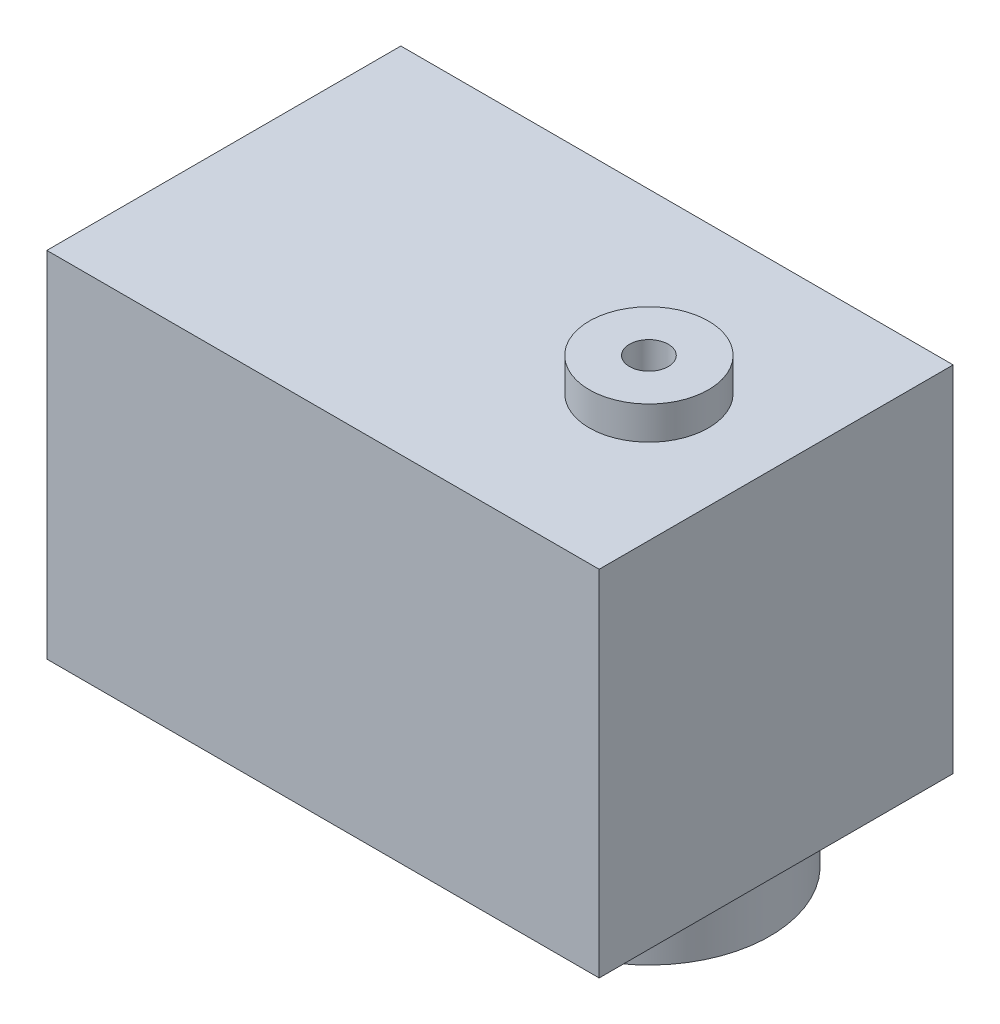
ISO-10303-21;
HEADER;
FILE_DESCRIPTION(('STEP AP214'),'2;1');
FILE_NAME('part.step','',(''),(''),'','','');
FILE_SCHEMA(('AUTOMOTIVE_DESIGN { 1 0 10303 214 1 1 1 1 }'));
ENDSEC;
DATA;
#1=APPLICATION_CONTEXT('core data for automotive mechanical design processes');
#2=APPLICATION_PROTOCOL_DEFINITION('international standard','automotive_design',2000,#1);
#3=PRODUCT_CONTEXT('',#1,'mechanical');
#4=PRODUCT('Part','Part','',(#3));
#5=PRODUCT_RELATED_PRODUCT_CATEGORY('part','',(#4));
#6=PRODUCT_DEFINITION_FORMATION('','',#4);
#7=PRODUCT_DEFINITION_CONTEXT('part definition',#1,'design');
#8=PRODUCT_DEFINITION('design','',#6,#7);
#9=PRODUCT_DEFINITION_SHAPE('','',#8);
#10=(LENGTH_UNIT() NAMED_UNIT(*) SI_UNIT(.MILLI.,.METRE.));
#11=(NAMED_UNIT(*) PLANE_ANGLE_UNIT() SI_UNIT($,.RADIAN.));
#12=(NAMED_UNIT(*) SI_UNIT($,.STERADIAN.) SOLID_ANGLE_UNIT());
#13=UNCERTAINTY_MEASURE_WITH_UNIT(LENGTH_MEASURE(1.E-05),#10,'distance_accuracy_value','');
#14=(GEOMETRIC_REPRESENTATION_CONTEXT(3) GLOBAL_UNCERTAINTY_ASSIGNED_CONTEXT((#13)) GLOBAL_UNIT_ASSIGNED_CONTEXT((#10,
#11,#12)) REPRESENTATION_CONTEXT('',''));
#15=CARTESIAN_POINT('',(0.,0.,0.));
#16=DIRECTION('',(0.,0.,1.));
#17=DIRECTION('',(1.,0.,0.));
#18=AXIS2_PLACEMENT_3D('',#15,#16,#17);
#19=CARTESIAN_POINT('',(-38.4302,-32.004,16.002));
#20=DIRECTION('',(0.,1.,0.));
#21=DIRECTION('',(0.,0.,1.));
#22=AXIS2_PLACEMENT_3D('',#19,#20,#21);
#23=PLANE('',#22);
#24=DIRECTION('',(0.,0.,1.));
#25=VECTOR('',#24,1.);
#26=CARTESIAN_POINT('',(-38.4302,-32.004,-16.002));
#27=LINE('',#26,#25);
#28=CARTESIAN_POINT('',(-38.4302,-32.004,-16.002));
#29=VERTEX_POINT('',#28);
#30=CARTESIAN_POINT('',(-38.4302,-32.004,16.002));
#31=VERTEX_POINT('',#30);
#32=EDGE_CURVE('E404',#29,#31,#27,.T.);
#33=ORIENTED_EDGE('',*,*,#32,.F.);
#34=DIRECTION('',(-1.,0.,0.));
#35=VECTOR('',#34,1.);
#36=CARTESIAN_POINT('',(-38.4302,-32.004,-16.002));
#37=LINE('',#36,#35);
#38=CARTESIAN_POINT('',(11.5062,-32.004,-16.002));
#39=VERTEX_POINT('',#38);
#40=EDGE_CURVE('E409',#39,#29,#37,.T.);
#41=ORIENTED_EDGE('',*,*,#40,.F.);
#42=DIRECTION('',(0.,0.,-1.));
#43=VECTOR('',#42,1.);
#44=CARTESIAN_POINT('',(11.5062,-32.004,-16.002));
#45=LINE('',#44,#43);
#46=CARTESIAN_POINT('',(11.5062,-32.004,16.002));
#47=VERTEX_POINT('',#46);
#48=EDGE_CURVE('E433',#47,#39,#45,.T.);
#49=ORIENTED_EDGE('',*,*,#48,.F.);
#50=DIRECTION('',(1.,0.,0.));
#51=VECTOR('',#50,1.);
#52=CARTESIAN_POINT('',(-38.4302,-32.004,16.002));
#53=LINE('',#52,#51);
#54=EDGE_CURVE('E431',#31,#47,#53,.T.);
#55=ORIENTED_EDGE('',*,*,#54,.F.);
#56=EDGE_LOOP('',(#33,#41,#49,#55));
#57=FACE_BOUND('',#56,.T.);
#58=CARTESIAN_POINT('',(0.,-32.004,0.));
#59=DIRECTION('',(0.,1.,0.));
#60=DIRECTION('',(0.,0.,1.));
#61=AXIS2_PLACEMENT_3D('',#58,#59,#60);
#62=CIRCLE('',#61,10.9474);
#63=CARTESIAN_POINT('',(0.,-32.004,10.9474));
#64=VERTEX_POINT('',#63);
#65=EDGE_CURVE('E11',#64,#64,#62,.F.);
#66=ORIENTED_EDGE('',*,*,#65,.F.);
#67=EDGE_LOOP('',(#66));
#68=FACE_BOUND('',#67,.T.);
#69=ADVANCED_FACE('F360',(#57,#68),#23,.F.);
#70=CARTESIAN_POINT('',(-38.4302,0.,16.002));
#71=DIRECTION('',(0.,1.,0.));
#72=DIRECTION('',(0.,0.,1.));
#73=AXIS2_PLACEMENT_3D('',#70,#71,#72);
#74=PLANE('',#73);
#75=DIRECTION('',(0.,0.,1.));
#76=VECTOR('',#75,1.);
#77=CARTESIAN_POINT('',(-38.4302,0.,-16.002));
#78=LINE('',#77,#76);
#79=CARTESIAN_POINT('',(-38.4302,0.,-16.002));
#80=VERTEX_POINT('',#79);
#81=CARTESIAN_POINT('',(-38.4302,0.,16.002));
#82=VERTEX_POINT('',#81);
#83=EDGE_CURVE('E402',#80,#82,#78,.T.);
#84=ORIENTED_EDGE('',*,*,#83,.T.);
#85=DIRECTION('',(1.,0.,0.));
#86=VECTOR('',#85,1.);
#87=CARTESIAN_POINT('',(-38.4302,0.,16.002));
#88=LINE('',#87,#86);
#89=CARTESIAN_POINT('',(11.5062,0.,16.002));
#90=VERTEX_POINT('',#89);
#91=EDGE_CURVE('E411',#82,#90,#88,.T.);
#92=ORIENTED_EDGE('',*,*,#91,.T.);
#93=DIRECTION('',(0.,0.,-1.));
#94=VECTOR('',#93,1.);
#95=CARTESIAN_POINT('',(11.5062,0.,-16.002));
#96=LINE('',#95,#94);
#97=CARTESIAN_POINT('',(11.5062,0.,-16.002));
#98=VERTEX_POINT('',#97);
#99=EDGE_CURVE('E416',#90,#98,#96,.T.);
#100=ORIENTED_EDGE('',*,*,#99,.T.);
#101=DIRECTION('',(-1.,0.,0.));
#102=VECTOR('',#101,1.);
#103=CARTESIAN_POINT('',(-38.4302,0.,-16.002));
#104=LINE('',#103,#102);
#105=EDGE_CURVE('E420',#98,#80,#104,.T.);
#106=ORIENTED_EDGE('',*,*,#105,.T.);
#107=EDGE_LOOP('',(#84,#92,#100,#106));
#108=FACE_BOUND('',#107,.T.);
#109=CARTESIAN_POINT('',(0.,0.,0.));
#110=DIRECTION('',(0.,1.,0.));
#111=DIRECTION('',(0.,0.,1.));
#112=AXIS2_PLACEMENT_3D('',#109,#110,#111);
#113=CIRCLE('',#112,5.3848);
#114=CARTESIAN_POINT('',(0.,0.,5.3848));
#115=VERTEX_POINT('',#114);
#116=EDGE_CURVE('E424',#115,#115,#113,.T.);
#117=ORIENTED_EDGE('',*,*,#116,.F.);
#118=EDGE_LOOP('',(#117));
#119=FACE_BOUND('',#118,.T.);
#120=ADVANCED_FACE('F418',(#108,#119),#74,.T.);
#121=CARTESIAN_POINT('',(-38.4302,-32.004,-16.002));
#122=DIRECTION('',(-1.,0.,0.));
#123=DIRECTION('',(0.,0.,1.));
#124=AXIS2_PLACEMENT_3D('',#121,#122,#123);
#125=PLANE('',#124);
#126=ORIENTED_EDGE('',*,*,#83,.F.);
#127=DIRECTION('',(0.,1.,0.));
#128=VECTOR('',#127,1.);
#129=CARTESIAN_POINT('',(-38.4302,-32.004,-16.002));
#130=LINE('',#129,#128);
#131=EDGE_CURVE('E368',#29,#80,#130,.T.);
#132=ORIENTED_EDGE('',*,*,#131,.F.);
#133=ORIENTED_EDGE('',*,*,#32,.T.);
#134=DIRECTION('',(0.,1.,0.));
#135=VECTOR('',#134,1.);
#136=CARTESIAN_POINT('',(-38.4302,-32.004,16.002));
#137=LINE('',#136,#135);
#138=EDGE_CURVE('E399',#31,#82,#137,.T.);
#139=ORIENTED_EDGE('',*,*,#138,.T.);
#140=EDGE_LOOP('',(#126,#132,#133,#139));
#141=FACE_BOUND('',#140,.T.);
#142=ADVANCED_FACE('F362',(#141),#125,.T.);
#143=CARTESIAN_POINT('',(-38.4302,-32.004,-16.002));
#144=DIRECTION('',(0.,0.,-1.));
#145=DIRECTION('',(-1.,0.,0.));
#146=AXIS2_PLACEMENT_3D('',#143,#144,#145);
#147=PLANE('',#146);
#148=ORIENTED_EDGE('',*,*,#105,.F.);
#149=DIRECTION('',(0.,1.,0.));
#150=VECTOR('',#149,1.);
#151=CARTESIAN_POINT('',(11.5062,-32.004,-16.002));
#152=LINE('',#151,#150);
#153=EDGE_CURVE('E382',#39,#98,#152,.T.);
#154=ORIENTED_EDGE('',*,*,#153,.F.);
#155=ORIENTED_EDGE('',*,*,#40,.T.);
#156=ORIENTED_EDGE('',*,*,#131,.T.);
#157=EDGE_LOOP('',(#148,#154,#155,#156));
#158=FACE_BOUND('',#157,.T.);
#159=ADVANCED_FACE('F442',(#158),#147,.T.);
#160=CARTESIAN_POINT('',(11.5062,-32.004,-16.002));
#161=DIRECTION('',(1.,0.,0.));
#162=DIRECTION('',(0.,0.,-1.));
#163=AXIS2_PLACEMENT_3D('',#160,#161,#162);
#164=PLANE('',#163);
#165=ORIENTED_EDGE('',*,*,#99,.F.);
#166=DIRECTION('',(0.,1.,0.));
#167=VECTOR('',#166,1.);
#168=CARTESIAN_POINT('',(11.5062,-32.004,16.002));
#169=LINE('',#168,#167);
#170=EDGE_CURVE('E408',#47,#90,#169,.T.);
#171=ORIENTED_EDGE('',*,*,#170,.F.);
#172=ORIENTED_EDGE('',*,*,#48,.T.);
#173=ORIENTED_EDGE('',*,*,#153,.T.);
#174=EDGE_LOOP('',(#165,#171,#172,#173));
#175=FACE_BOUND('',#174,.T.);
#176=ADVANCED_FACE('F439',(#175),#164,.T.);
#177=CARTESIAN_POINT('',(-38.4302,-32.004,16.002));
#178=DIRECTION('',(0.,0.,1.));
#179=DIRECTION('',(1.,0.,0.));
#180=AXIS2_PLACEMENT_3D('',#177,#178,#179);
#181=PLANE('',#180);
#182=ORIENTED_EDGE('',*,*,#91,.F.);
#183=ORIENTED_EDGE('',*,*,#138,.F.);
#184=ORIENTED_EDGE('',*,*,#54,.T.);
#185=ORIENTED_EDGE('',*,*,#170,.T.);
#186=EDGE_LOOP('',(#182,#183,#184,#185));
#187=FACE_BOUND('',#186,.T.);
#188=ADVANCED_FACE('F412',(#187),#181,.T.);
#189=CARTESIAN_POINT('',(0.,2.99085,0.));
#190=DIRECTION('',(0.,-1.,0.));
#191=DIRECTION('',(0.,0.,-1.));
#192=AXIS2_PLACEMENT_3D('',#189,#190,#191);
#193=CYLINDRICAL_SURFACE('',#192,5.3848);
#194=CARTESIAN_POINT('',(0.,2.99085,0.));
#195=DIRECTION('',(0.,1.,0.));
#196=DIRECTION('',(0.,0.,1.));
#197=AXIS2_PLACEMENT_3D('',#194,#195,#196);
#198=CIRCLE('',#197,5.3848);
#199=CARTESIAN_POINT('',(0.,2.99085,5.3848));
#200=VERTEX_POINT('',#199);
#201=EDGE_CURVE('E421',#200,#200,#198,.T.);
#202=ORIENTED_EDGE('',*,*,#201,.F.);
#203=EDGE_LOOP('',(#202));
#204=FACE_BOUND('',#203,.T.);
#205=ORIENTED_EDGE('',*,*,#116,.T.);
#206=EDGE_LOOP('',(#205));
#207=FACE_BOUND('',#206,.T.);
#208=ADVANCED_FACE('F474',(#204,#207),#193,.T.);
#209=CARTESIAN_POINT('',(0.,2.99085,0.));
#210=DIRECTION('',(0.,1.,0.));
#211=DIRECTION('',(0.,0.,1.));
#212=AXIS2_PLACEMENT_3D('',#209,#210,#211);
#213=PLANE('',#212);
#214=CARTESIAN_POINT('',(0.,2.99085,0.));
#215=DIRECTION('',(0.,1.,0.));
#216=DIRECTION('',(0.,0.,1.));
#217=AXIS2_PLACEMENT_3D('',#214,#215,#216);
#218=CIRCLE('',#217,1.7526);
#219=CARTESIAN_POINT('',(0.,2.99085,1.7526));
#220=VERTEX_POINT('',#219);
#221=EDGE_CURVE('E542',#220,#220,#218,.T.);
#222=ORIENTED_EDGE('',*,*,#221,.F.);
#223=EDGE_LOOP('',(#222));
#224=FACE_BOUND('',#223,.T.);
#225=ORIENTED_EDGE('',*,*,#201,.T.);
#226=EDGE_LOOP('',(#225));
#227=FACE_BOUND('',#226,.T.);
#228=ADVANCED_FACE('F470',(#224,#227),#213,.T.);
#229=CARTESIAN_POINT('',(0.,-8.99795,0.));
#230=DIRECTION('',(0.,1.,0.));
#231=DIRECTION('',(0.,0.,1.));
#232=AXIS2_PLACEMENT_3D('',#229,#230,#231);
#233=CYLINDRICAL_SURFACE('',#232,1.7526);
#234=CARTESIAN_POINT('',(0.,-8.99795,0.));
#235=DIRECTION('',(0.,1.,0.));
#236=DIRECTION('',(0.,0.,1.));
#237=AXIS2_PLACEMENT_3D('',#234,#235,#236);
#238=CIRCLE('',#237,1.7526);
#239=CARTESIAN_POINT('',(0.,-8.99795,1.7526));
#240=VERTEX_POINT('',#239);
#241=EDGE_CURVE('E549',#240,#240,#238,.T.);
#242=CARTESIAN_POINT('',(0.,-8.99795,1.7526));
#243=CARTESIAN_POINT('',(0.,-8.87306666666667,1.7526));
#244=CARTESIAN_POINT('',(0.,-8.74818333333334,1.7526));
#245=CARTESIAN_POINT('',(0.,-8.49841666666667,1.7526));
#246=CARTESIAN_POINT('',(0.,-8.37353333333333,1.7526));
#247=CARTESIAN_POINT('',(0.,-8.12376666666667,1.7526));
#248=CARTESIAN_POINT('',(0.,-7.99888333333333,1.7526));
#249=CARTESIAN_POINT('',(0.,-7.74911666666667,1.7526));
#250=CARTESIAN_POINT('',(0.,-7.62423333333333,1.7526));
#251=CARTESIAN_POINT('',(0.,-7.37446666666667,1.7526));
#252=CARTESIAN_POINT('',(0.,-7.24958333333333,1.7526));
#253=CARTESIAN_POINT('',(0.,-6.99981666666667,1.7526));
#254=CARTESIAN_POINT('',(0.,-6.87493333333333,1.7526));
#255=CARTESIAN_POINT('',(0.,-6.62516666666667,1.7526));
#256=CARTESIAN_POINT('',(0.,-6.50028333333333,1.7526));
#257=CARTESIAN_POINT('',(0.,-6.25051666666667,1.7526));
#258=CARTESIAN_POINT('',(0.,-6.12563333333333,1.7526));
#259=CARTESIAN_POINT('',(0.,-5.87586666666667,1.7526));
#260=CARTESIAN_POINT('',(0.,-5.75098333333333,1.7526));
#261=CARTESIAN_POINT('',(0.,-5.50121666666667,1.7526));
#262=CARTESIAN_POINT('',(0.,-5.37633333333333,1.7526));
#263=CARTESIAN_POINT('',(0.,-5.12656666666667,1.7526));
#264=CARTESIAN_POINT('',(0.,-5.00168333333333,1.7526));
#265=CARTESIAN_POINT('',(0.,-4.75191666666667,1.7526));
#266=CARTESIAN_POINT('',(0.,-4.62703333333333,1.7526));
#267=CARTESIAN_POINT('',(0.,-4.37726666666667,1.7526));
#268=CARTESIAN_POINT('',(0.,-4.25238333333333,1.7526));
#269=CARTESIAN_POINT('',(0.,-4.00261666666667,1.7526));
#270=CARTESIAN_POINT('',(0.,-3.87773333333333,1.7526));
#271=CARTESIAN_POINT('',(0.,-3.62796666666667,1.7526));
#272=CARTESIAN_POINT('',(0.,-3.50308333333333,1.7526));
#273=CARTESIAN_POINT('',(0.,-3.25331666666667,1.7526));
#274=CARTESIAN_POINT('',(0.,-3.12843333333333,1.7526));
#275=CARTESIAN_POINT('',(0.,-2.87866666666667,1.7526));
#276=CARTESIAN_POINT('',(0.,-2.75378333333333,1.7526));
#277=CARTESIAN_POINT('',(0.,-2.50401666666667,1.7526));
#278=CARTESIAN_POINT('',(0.,-2.37913333333333,1.7526));
#279=CARTESIAN_POINT('',(0.,-2.12936666666667,1.7526));
#280=CARTESIAN_POINT('',(0.,-2.00448333333333,1.7526));
#281=CARTESIAN_POINT('',(0.,-1.75471666666667,1.7526));
#282=CARTESIAN_POINT('',(0.,-1.62983333333333,1.7526));
#283=CARTESIAN_POINT('',(0.,-1.38006666666667,1.7526));
#284=CARTESIAN_POINT('',(0.,-1.25518333333333,1.7526));
#285=CARTESIAN_POINT('',(0.,-1.00541666666667,1.7526));
#286=CARTESIAN_POINT('',(0.,-0.880533333333335,1.7526));
#287=CARTESIAN_POINT('',(0.,-0.630766666666668,1.7526));
#288=CARTESIAN_POINT('',(0.,-0.505883333333335,1.7526));
#289=CARTESIAN_POINT('',(0.,-0.256116666666668,1.7526));
#290=CARTESIAN_POINT('',(0.,-0.131233333333334,1.7526));
#291=CARTESIAN_POINT('',(0.,0.118533333333333,1.7526));
#292=CARTESIAN_POINT('',(0.,0.243416666666666,1.7526));
#293=CARTESIAN_POINT('',(0.,0.493183333333332,1.7526));
#294=CARTESIAN_POINT('',(0.,0.618066666666666,1.7526));
#295=CARTESIAN_POINT('',(0.,0.867833333333333,1.7526));
#296=CARTESIAN_POINT('',(0.,0.992716666666666,1.7526));
#297=CARTESIAN_POINT('',(0.,1.24248333333333,1.7526));
#298=CARTESIAN_POINT('',(0.,1.36736666666667,1.7526));
#299=CARTESIAN_POINT('',(0.,1.61713333333333,1.7526));
#300=CARTESIAN_POINT('',(0.,1.74201666666667,1.7526));
#301=CARTESIAN_POINT('',(0.,1.99178333333333,1.7526));
#302=CARTESIAN_POINT('',(0.,2.11666666666667,1.7526));
#303=CARTESIAN_POINT('',(0.,2.36643333333333,1.7526));
#304=CARTESIAN_POINT('',(0.,2.49131666666667,1.7526));
#305=CARTESIAN_POINT('',(0.,2.74108333333333,1.7526));
#306=CARTESIAN_POINT('',(0.,2.86596666666667,1.7526));
#307=CARTESIAN_POINT('',(0.,2.99085,1.7526));
#308=B_SPLINE_CURVE_WITH_KNOTS('',3,(#242,#243,#244,#245,#246,#247,#248,#249,#250,#251,#252,
#253,#254,#255,#256,#257,#258,#259,#260,#261,#262,#263,#264,#265,#266,#267,#268,#269,#270,#271,
#272,#273,#274,#275,#276,#277,#278,#279,#280,#281,#282,#283,#284,#285,#286,#287,#288,#289,#290,
#291,#292,#293,#294,#295,#296,#297,#298,#299,#300,#301,#302,#303,#304,#305,#306,#307),
.UNSPECIFIED.,.F.,.F.,(4,2,2,2,2,2,2,2,2,2,2,2,2,2,2,2,2,2,2,2,2,2,2,2,2,2,2,2,2,2,2,2,4),(0.,
0.374650000000001,0.749300000000001,1.12395,1.4986,1.87325,2.2479,2.62255,2.9972,3.37185,3.7465,
4.12115,4.4958,4.87045,5.2451,5.61975,5.9944,6.36905,6.7437,7.11835,7.493,7.86765,8.2423,
8.61695,8.9916,9.36625,9.7409,10.11555,10.4902,10.86485,11.2395,11.61415,11.9888),.UNSPECIFIED.);
#309=EDGE_CURVE('BSEAM462',#240,#220,#308,.T.);
#310=ORIENTED_EDGE('',*,*,#241,.F.);
#311=ORIENTED_EDGE('',*,*,#221,.T.);
#312=ORIENTED_EDGE('',*,*,#309,.T.);
#313=ORIENTED_EDGE('',*,*,#309,.F.);
#314=EDGE_LOOP('',(#310,#312,#311,#313));
#315=FACE_BOUND('',#314,.T.);
#316=ADVANCED_FACE('F462',(#315),#233,.F.);
#317=CARTESIAN_POINT('',(0.,-8.99795,0.));
#318=DIRECTION('',(0.,1.,0.));
#319=DIRECTION('',(0.,0.,1.));
#320=AXIS2_PLACEMENT_3D('',#317,#318,#319);
#321=PLANE('',#320);
#322=ORIENTED_EDGE('',*,*,#241,.T.);
#323=EDGE_LOOP('',(#322));
#324=FACE_BOUND('',#323,.T.);
#325=ADVANCED_FACE('F452',(#324),#321,.T.);
#326=CARTESIAN_POINT('',(0.,-37.0078,0.));
#327=DIRECTION('',(0.,1.,0.));
#328=DIRECTION('',(0.,0.,1.));
#329=AXIS2_PLACEMENT_3D('',#326,#327,#328);
#330=CYLINDRICAL_SURFACE('',#329,10.9474);
#331=CARTESIAN_POINT('',(0.,-37.0078,0.));
#332=DIRECTION('',(0.,-1.,0.));
#333=DIRECTION('',(0.,0.,-1.));
#334=AXIS2_PLACEMENT_3D('',#331,#332,#333);
#335=CIRCLE('',#334,10.9474);
#336=CARTESIAN_POINT('',(0.,-37.0078,-10.9474));
#337=VERTEX_POINT('',#336);
#338=EDGE_CURVE('E538',#337,#337,#335,.T.);
#339=ORIENTED_EDGE('',*,*,#338,.F.);
#340=EDGE_LOOP('',(#339));
#341=FACE_BOUND('',#340,.T.);
#342=ORIENTED_EDGE('',*,*,#65,.T.);
#343=EDGE_LOOP('',(#342));
#344=FACE_BOUND('',#343,.T.);
#345=ADVANCED_FACE('F449',(#341,#344),#330,.T.);
#346=CARTESIAN_POINT('',(0.,-37.0078,0.));
#347=DIRECTION('',(0.,-1.,0.));
#348=DIRECTION('',(0.,0.,-1.));
#349=AXIS2_PLACEMENT_3D('',#346,#347,#348);
#350=PLANE('',#349);
#351=CARTESIAN_POINT('',(0.,-37.0078,0.));
#352=DIRECTION('',(0.,-1.,0.));
#353=DIRECTION('',(0.,0.,-1.));
#354=AXIS2_PLACEMENT_3D('',#351,#352,#353);
#355=CIRCLE('',#354,2.9972);
#356=CARTESIAN_POINT('',(0.,-37.0078,-2.9972));
#357=VERTEX_POINT('',#356);
#358=EDGE_CURVE('E539',#357,#357,#355,.T.);
#359=ORIENTED_EDGE('',*,*,#358,.F.);
#360=EDGE_LOOP('',(#359));
#361=FACE_BOUND('',#360,.T.);
#362=ORIENTED_EDGE('',*,*,#338,.T.);
#363=EDGE_LOOP('',(#362));
#364=FACE_BOUND('',#363,.T.);
#365=ADVANCED_FACE('F451',(#361,#364),#350,.T.);
#366=CARTESIAN_POINT('',(0.,-28.0162,0.));
#367=DIRECTION('',(0.,-1.,0.));
#368=DIRECTION('',(0.,0.,-1.));
#369=AXIS2_PLACEMENT_3D('',#366,#367,#368);
#370=CYLINDRICAL_SURFACE('',#369,2.9972);
#371=CARTESIAN_POINT('',(0.,-28.0162,0.));
#372=DIRECTION('',(0.,-1.,0.));
#373=DIRECTION('',(0.,0.,-1.));
#374=AXIS2_PLACEMENT_3D('',#371,#372,#373);
#375=CIRCLE('',#374,2.9972);
#376=CARTESIAN_POINT('',(0.,-28.0162,-2.9972));
#377=VERTEX_POINT('',#376);
#378=EDGE_CURVE('E537',#377,#377,#375,.T.);
#379=ORIENTED_EDGE('',*,*,#378,.F.);
#380=EDGE_LOOP('',(#379));
#381=FACE_BOUND('',#380,.T.);
#382=ORIENTED_EDGE('',*,*,#358,.T.);
#383=EDGE_LOOP('',(#382));
#384=FACE_BOUND('',#383,.T.);
#385=ADVANCED_FACE('F458',(#381,#384),#370,.F.);
#386=CARTESIAN_POINT('',(0.,-28.0162,0.));
#387=DIRECTION('',(0.,-1.,0.));
#388=DIRECTION('',(0.,0.,-1.));
#389=AXIS2_PLACEMENT_3D('',#386,#387,#388);
#390=PLANE('',#389);
#391=ORIENTED_EDGE('',*,*,#378,.T.);
#392=EDGE_LOOP('',(#391));
#393=FACE_BOUND('',#392,.T.);
#394=ADVANCED_FACE('F526',(#393),#390,.T.);
#395=CLOSED_SHELL('',(#69,#120,#142,#159,#176,#188,#208,#228,#316,#325,#345,#365,#385,#394));
#396=MANIFOLD_SOLID_BREP('B2',#395);
#397=ADVANCED_BREP_SHAPE_REPRESENTATION('',(#18,#396),#14);
#398=SHAPE_DEFINITION_REPRESENTATION(#9,#397);
ENDSEC;
END-ISO-10303-21;
